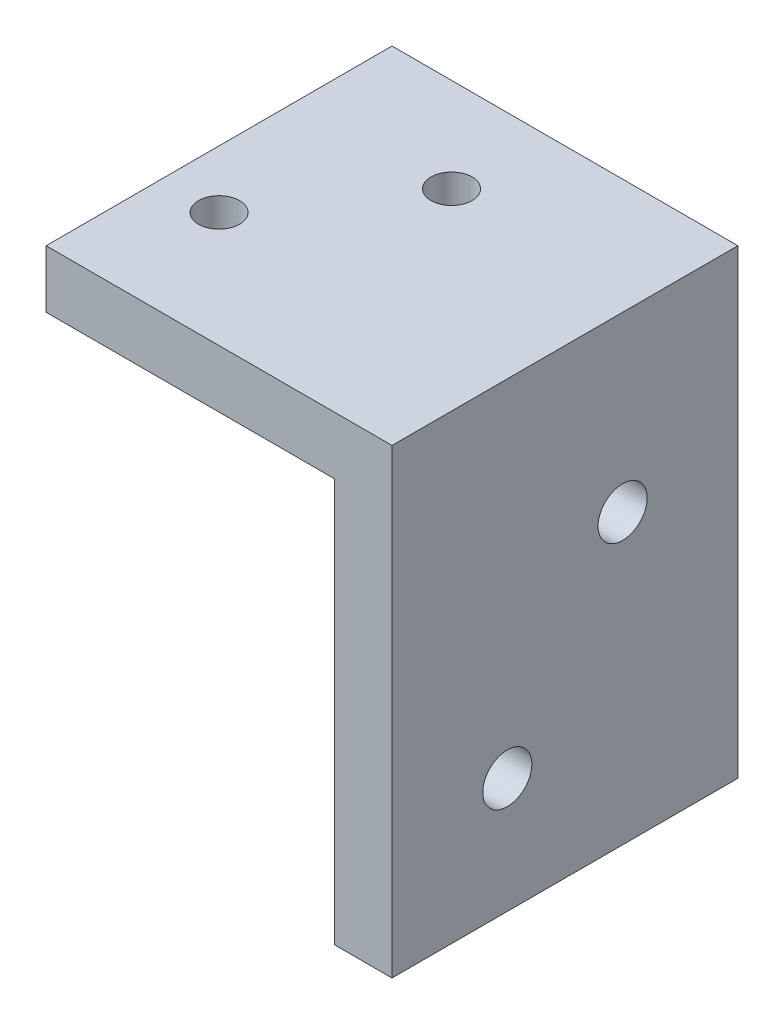
ISO-10303-21;
HEADER;
FILE_DESCRIPTION(('STEP AP214'),'2;1');
FILE_NAME('part.step','',(''),(''),'','','');
FILE_SCHEMA(('AUTOMOTIVE_DESIGN { 1 0 10303 214 1 1 1 1 }'));
ENDSEC;
DATA;
#1=APPLICATION_CONTEXT('core data for automotive mechanical design processes');
#2=APPLICATION_PROTOCOL_DEFINITION('international standard','automotive_design',2000,#1);
#3=PRODUCT_CONTEXT('',#1,'mechanical');
#4=PRODUCT('Part','Part','',(#3));
#5=PRODUCT_RELATED_PRODUCT_CATEGORY('part','',(#4));
#6=PRODUCT_DEFINITION_FORMATION('','',#4);
#7=PRODUCT_DEFINITION_CONTEXT('part definition',#1,'design');
#8=PRODUCT_DEFINITION('design','',#6,#7);
#9=PRODUCT_DEFINITION_SHAPE('','',#8);
#10=(LENGTH_UNIT() NAMED_UNIT(*) SI_UNIT(.MILLI.,.METRE.));
#11=(NAMED_UNIT(*) PLANE_ANGLE_UNIT() SI_UNIT($,.RADIAN.));
#12=(NAMED_UNIT(*) SI_UNIT($,.STERADIAN.) SOLID_ANGLE_UNIT());
#13=UNCERTAINTY_MEASURE_WITH_UNIT(LENGTH_MEASURE(1.E-05),#10,'distance_accuracy_value','');
#14=(GEOMETRIC_REPRESENTATION_CONTEXT(3) GLOBAL_UNCERTAINTY_ASSIGNED_CONTEXT((#13)) GLOBAL_UNIT_ASSIGNED_CONTEXT((#10,
#11,#12)) REPRESENTATION_CONTEXT('',''));
#15=CARTESIAN_POINT('',(0.,0.,0.));
#16=DIRECTION('',(0.,0.,1.));
#17=DIRECTION('',(1.,0.,0.));
#18=AXIS2_PLACEMENT_3D('',#15,#16,#17);
#19=CARTESIAN_POINT('',(-59.9070745842942,30.8316115702479,-12.7));
#20=DIRECTION('',(-1.,0.,0.));
#21=DIRECTION('',(0.,-1.,0.));
#22=AXIS2_PLACEMENT_3D('',#19,#20,#21);
#23=PLANE('',#22);
#24=DIRECTION('',(0.,0.,1.));
#25=VECTOR('',#24,1.);
#26=CARTESIAN_POINT('',(-59.9070745842942,27.6566115702479,-12.7));
#27=LINE('',#26,#25);
#28=CARTESIAN_POINT('',(-59.9070745842942,27.6566115702479,-12.7));
#29=VERTEX_POINT('',#28);
#30=CARTESIAN_POINT('',(-59.9070745842942,27.6566115702479,6.35));
#31=VERTEX_POINT('',#30);
#32=EDGE_CURVE('E94',#29,#31,#27,.T.);
#33=ORIENTED_EDGE('',*,*,#32,.T.);
#34=DIRECTION('',(0.,-1.,0.));
#35=VECTOR('',#34,1.);
#36=CARTESIAN_POINT('',(-59.9070745842942,30.8316115702479,6.35));
#37=LINE('',#36,#35);
#38=CARTESIAN_POINT('',(-59.9070745842942,30.8316115702479,6.35));
#39=VERTEX_POINT('',#38);
#40=EDGE_CURVE('E97',#39,#31,#37,.T.);
#41=ORIENTED_EDGE('',*,*,#40,.F.);
#42=DIRECTION('',(0.,0.,1.));
#43=VECTOR('',#42,1.);
#44=CARTESIAN_POINT('',(-59.9070745842942,30.8316115702479,-12.7));
#45=LINE('',#44,#43);
#46=CARTESIAN_POINT('',(-59.9070745842942,30.8316115702479,-12.7));
#47=VERTEX_POINT('',#46);
#48=EDGE_CURVE('E13',#47,#39,#45,.T.);
#49=ORIENTED_EDGE('',*,*,#48,.F.);
#50=DIRECTION('',(0.,-1.,0.));
#51=VECTOR('',#50,1.);
#52=CARTESIAN_POINT('',(-59.9070745842942,30.8316115702479,-12.7));
#53=LINE('',#52,#51);
#54=EDGE_CURVE('E98',#47,#29,#53,.T.);
#55=ORIENTED_EDGE('',*,*,#54,.T.);
#56=EDGE_LOOP('',(#33,#41,#49,#55));
#57=FACE_BOUND('',#56,.T.);
#58=ADVANCED_FACE('F44',(#57),#23,.T.);
#59=CARTESIAN_POINT('',(-59.9070745842942,30.8316115702479,-12.7));
#60=DIRECTION('',(0.,1.,0.));
#61=DIRECTION('',(0.,0.,1.));
#62=AXIS2_PLACEMENT_3D('',#59,#60,#61);
#63=PLANE('',#62);
#64=CARTESIAN_POINT('',(-51.4581539673336,30.8316115702479,-7.53193921682841));
#65=DIRECTION('',(0.,1.,0.));
#66=DIRECTION('',(0.,0.,1.));
#67=AXIS2_PLACEMENT_3D('',#64,#65,#66);
#68=CIRCLE('',#67,1.1303);
#69=CARTESIAN_POINT('',(-51.4581539673336,30.8316115702479,-6.40163921682841));
#70=VERTEX_POINT('',#69);
#71=EDGE_CURVE('E162',#70,#70,#68,.T.);
#72=ORIENTED_EDGE('',*,*,#71,.F.);
#73=EDGE_LOOP('',(#72));
#74=FACE_BOUND('',#73,.T.);
#75=CARTESIAN_POINT('',(-56.7320745842942,30.8316115702479,0.));
#76=DIRECTION('',(0.,1.,0.));
#77=DIRECTION('',(0.,0.,1.));
#78=AXIS2_PLACEMENT_3D('',#75,#76,#77);
#79=CIRCLE('',#78,1.1303);
#80=CARTESIAN_POINT('',(-56.7320745842942,30.8316115702479,1.1303));
#81=VERTEX_POINT('',#80);
#82=EDGE_CURVE('E151',#81,#81,#79,.T.);
#83=ORIENTED_EDGE('',*,*,#82,.F.);
#84=EDGE_LOOP('',(#83));
#85=FACE_BOUND('',#84,.T.);
#86=ORIENTED_EDGE('',*,*,#48,.T.);
#87=DIRECTION('',(-1.,0.,0.));
#88=VECTOR('',#87,1.);
#89=CARTESIAN_POINT('',(-59.9070745842942,30.8316115702479,6.35));
#90=LINE('',#89,#88);
#91=CARTESIAN_POINT('',(-40.8570745842942,30.8316115702479,6.35));
#92=VERTEX_POINT('',#91);
#93=EDGE_CURVE('E116',#92,#39,#90,.T.);
#94=ORIENTED_EDGE('',*,*,#93,.F.);
#95=DIRECTION('',(0.,0.,1.));
#96=VECTOR('',#95,1.);
#97=CARTESIAN_POINT('',(-40.8570745842942,30.8316115702479,-12.7));
#98=LINE('',#97,#96);
#99=CARTESIAN_POINT('',(-40.8570745842942,30.8316115702479,-12.7));
#100=VERTEX_POINT('',#99);
#101=EDGE_CURVE('E52',#100,#92,#98,.T.);
#102=ORIENTED_EDGE('',*,*,#101,.F.);
#103=DIRECTION('',(-1.,0.,0.));
#104=VECTOR('',#103,1.);
#105=CARTESIAN_POINT('',(-59.9070745842942,30.8316115702479,-12.7));
#106=LINE('',#105,#104);
#107=EDGE_CURVE('E103',#100,#47,#106,.T.);
#108=ORIENTED_EDGE('',*,*,#107,.T.);
#109=EDGE_LOOP('',(#86,#94,#102,#108));
#110=FACE_BOUND('',#109,.T.);
#111=ADVANCED_FACE('F188',(#74,#85,#110),#63,.T.);
#112=CARTESIAN_POINT('',(-40.8570745842942,30.8316115702479,-12.7));
#113=DIRECTION('',(1.,0.,0.));
#114=DIRECTION('',(0.,1.,0.));
#115=AXIS2_PLACEMENT_3D('',#112,#113,#114);
#116=PLANE('',#115);
#117=CARTESIAN_POINT('',(-40.8570745842942,11.7816115702479,0.));
#118=DIRECTION('',(-1.,0.,0.));
#119=DIRECTION('',(0.,0.,1.));
#120=AXIS2_PLACEMENT_3D('',#117,#118,#119);
#121=CIRCLE('',#120,1.35255);
#122=CARTESIAN_POINT('',(-40.8570745842942,11.7816115702479,1.35255));
#123=VERTEX_POINT('',#122);
#124=EDGE_CURVE('E155',#123,#123,#121,.T.);
#125=ORIENTED_EDGE('',*,*,#124,.T.);
#126=EDGE_LOOP('',(#125));
#127=FACE_BOUND('',#126,.T.);
#128=CARTESIAN_POINT('',(-40.8570745842942,21.3066115702479,-6.35));
#129=DIRECTION('',(-1.,0.,0.));
#130=DIRECTION('',(0.,0.,1.));
#131=AXIS2_PLACEMENT_3D('',#128,#129,#130);
#132=CIRCLE('',#131,1.35255);
#133=CARTESIAN_POINT('',(-40.8570745842942,21.3066115702479,-4.99745));
#134=VERTEX_POINT('',#133);
#135=EDGE_CURVE('E117',#134,#134,#132,.T.);
#136=ORIENTED_EDGE('',*,*,#135,.T.);
#137=EDGE_LOOP('',(#136));
#138=FACE_BOUND('',#137,.T.);
#139=ORIENTED_EDGE('',*,*,#101,.T.);
#140=DIRECTION('',(0.,1.,0.));
#141=VECTOR('',#140,1.);
#142=CARTESIAN_POINT('',(-40.8570745842942,30.8316115702479,6.35));
#143=LINE('',#142,#141);
#144=CARTESIAN_POINT('',(-40.8570745842942,5.43161157024793,6.35));
#145=VERTEX_POINT('',#144);
#146=EDGE_CURVE('E128',#145,#92,#143,.T.);
#147=ORIENTED_EDGE('',*,*,#146,.F.);
#148=DIRECTION('',(0.,0.,1.));
#149=VECTOR('',#148,1.);
#150=CARTESIAN_POINT('',(-40.8570745842942,5.43161157024793,-12.7));
#151=LINE('',#150,#149);
#152=CARTESIAN_POINT('',(-40.8570745842942,5.43161157024793,-12.7));
#153=VERTEX_POINT('',#152);
#154=EDGE_CURVE('E144',#153,#145,#151,.T.);
#155=ORIENTED_EDGE('',*,*,#154,.F.);
#156=DIRECTION('',(0.,1.,0.));
#157=VECTOR('',#156,1.);
#158=CARTESIAN_POINT('',(-40.8570745842942,30.8316115702479,-12.7));
#159=LINE('',#158,#157);
#160=EDGE_CURVE('E140',#153,#100,#159,.T.);
#161=ORIENTED_EDGE('',*,*,#160,.T.);
#162=EDGE_LOOP('',(#139,#147,#155,#161));
#163=FACE_BOUND('',#162,.T.);
#164=ADVANCED_FACE('F184',(#127,#138,#163),#116,.T.);
#165=CARTESIAN_POINT('',(-44.0320745842942,5.43161157024793,-12.7));
#166=DIRECTION('',(0.,-1.,0.));
#167=DIRECTION('',(1.,0.,0.));
#168=AXIS2_PLACEMENT_3D('',#165,#166,#167);
#169=PLANE('',#168);
#170=ORIENTED_EDGE('',*,*,#154,.T.);
#171=DIRECTION('',(1.,0.,0.));
#172=VECTOR('',#171,1.);
#173=CARTESIAN_POINT('',(-44.0320745842942,5.43161157024793,6.35));
#174=LINE('',#173,#172);
#175=CARTESIAN_POINT('',(-44.0320745842942,5.43161157024793,6.35));
#176=VERTEX_POINT('',#175);
#177=EDGE_CURVE('E125',#176,#145,#174,.T.);
#178=ORIENTED_EDGE('',*,*,#177,.F.);
#179=DIRECTION('',(0.,0.,1.));
#180=VECTOR('',#179,1.);
#181=CARTESIAN_POINT('',(-44.0320745842942,5.43161157024793,-12.7));
#182=LINE('',#181,#180);
#183=CARTESIAN_POINT('',(-44.0320745842942,5.43161157024793,-12.7));
#184=VERTEX_POINT('',#183);
#185=EDGE_CURVE('E146',#184,#176,#182,.T.);
#186=ORIENTED_EDGE('',*,*,#185,.F.);
#187=DIRECTION('',(1.,0.,0.));
#188=VECTOR('',#187,1.);
#189=CARTESIAN_POINT('',(-44.0320745842942,5.43161157024793,-12.7));
#190=LINE('',#189,#188);
#191=EDGE_CURVE('E137',#184,#153,#190,.T.);
#192=ORIENTED_EDGE('',*,*,#191,.T.);
#193=EDGE_LOOP('',(#170,#178,#186,#192));
#194=FACE_BOUND('',#193,.T.);
#195=ADVANCED_FACE('F174',(#194),#169,.T.);
#196=CARTESIAN_POINT('',(-44.0320745842942,27.6566115702479,-12.7));
#197=DIRECTION('',(-1.,0.,0.));
#198=DIRECTION('',(0.,0.,1.));
#199=AXIS2_PLACEMENT_3D('',#196,#197,#198);
#200=PLANE('',#199);
#201=CARTESIAN_POINT('',(-44.0320745842942,11.7816115702479,0.));
#202=DIRECTION('',(-1.,0.,0.));
#203=DIRECTION('',(0.,0.,1.));
#204=AXIS2_PLACEMENT_3D('',#201,#202,#203);
#205=CIRCLE('',#204,1.35254999999999);
#206=CARTESIAN_POINT('',(-44.0320745842942,11.7816115702479,1.35254999999999));
#207=VERTEX_POINT('',#206);
#208=EDGE_CURVE('E150',#207,#207,#205,.T.);
#209=ORIENTED_EDGE('',*,*,#208,.F.);
#210=EDGE_LOOP('',(#209));
#211=FACE_BOUND('',#210,.T.);
#212=CARTESIAN_POINT('',(-44.0320745842942,21.3066115702479,-6.35));
#213=DIRECTION('',(-1.,0.,0.));
#214=DIRECTION('',(0.,0.,1.));
#215=AXIS2_PLACEMENT_3D('',#212,#213,#214);
#216=CIRCLE('',#215,1.35254999999999);
#217=CARTESIAN_POINT('',(-44.0320745842942,21.3066115702479,-4.99745000000001));
#218=VERTEX_POINT('',#217);
#219=EDGE_CURVE('E120',#218,#218,#216,.T.);
#220=ORIENTED_EDGE('',*,*,#219,.F.);
#221=EDGE_LOOP('',(#220));
#222=FACE_BOUND('',#221,.T.);
#223=ORIENTED_EDGE('',*,*,#185,.T.);
#224=DIRECTION('',(0.,-1.,0.));
#225=VECTOR('',#224,1.);
#226=CARTESIAN_POINT('',(-44.0320745842942,27.6566115702479,6.35));
#227=LINE('',#226,#225);
#228=CARTESIAN_POINT('',(-44.0320745842942,27.6566115702479,6.35));
#229=VERTEX_POINT('',#228);
#230=EDGE_CURVE('E111',#229,#176,#227,.T.);
#231=ORIENTED_EDGE('',*,*,#230,.F.);
#232=DIRECTION('',(0.,0.,1.));
#233=VECTOR('',#232,1.);
#234=CARTESIAN_POINT('',(-44.0320745842942,27.6566115702479,-12.7));
#235=LINE('',#234,#233);
#236=CARTESIAN_POINT('',(-44.0320745842942,27.6566115702479,-12.7));
#237=VERTEX_POINT('',#236);
#238=EDGE_CURVE('E102',#237,#229,#235,.T.);
#239=ORIENTED_EDGE('',*,*,#238,.F.);
#240=DIRECTION('',(0.,-1.,0.));
#241=VECTOR('',#240,1.);
#242=CARTESIAN_POINT('',(-44.0320745842942,27.6566115702479,-12.7));
#243=LINE('',#242,#241);
#244=EDGE_CURVE('E134',#237,#184,#243,.T.);
#245=ORIENTED_EDGE('',*,*,#244,.T.);
#246=EDGE_LOOP('',(#223,#231,#239,#245));
#247=FACE_BOUND('',#246,.T.);
#248=ADVANCED_FACE('F171',(#211,#222,#247),#200,.T.);
#249=CARTESIAN_POINT('',(-59.9070745842942,27.6566115702479,-12.7));
#250=DIRECTION('',(0.,-1.,0.));
#251=DIRECTION('',(0.,0.,-1.));
#252=AXIS2_PLACEMENT_3D('',#249,#250,#251);
#253=PLANE('',#252);
#254=CARTESIAN_POINT('',(-51.4581539673336,27.6566115702479,-7.53193921682841));
#255=DIRECTION('',(0.,-1.,0.));
#256=DIRECTION('',(0.,0.,-1.));
#257=AXIS2_PLACEMENT_3D('',#254,#255,#256);
#258=CIRCLE('',#257,1.1303);
#259=CARTESIAN_POINT('',(-51.4581539673336,27.6566115702479,-8.66223921682841));
#260=VERTEX_POINT('',#259);
#261=EDGE_CURVE('E47',#260,#260,#258,.T.);
#262=ORIENTED_EDGE('',*,*,#261,.F.);
#263=EDGE_LOOP('',(#262));
#264=FACE_BOUND('',#263,.T.);
#265=CARTESIAN_POINT('',(-56.7320745842942,27.6566115702479,0.));
#266=DIRECTION('',(0.,-1.,0.));
#267=DIRECTION('',(0.,0.,-1.));
#268=AXIS2_PLACEMENT_3D('',#265,#266,#267);
#269=CIRCLE('',#268,1.1303);
#270=CARTESIAN_POINT('',(-56.7320745842942,27.6566115702479,-1.1303));
#271=VERTEX_POINT('',#270);
#272=EDGE_CURVE('E148',#271,#271,#269,.T.);
#273=ORIENTED_EDGE('',*,*,#272,.F.);
#274=EDGE_LOOP('',(#273));
#275=FACE_BOUND('',#274,.T.);
#276=ORIENTED_EDGE('',*,*,#238,.T.);
#277=DIRECTION('',(1.,0.,0.));
#278=VECTOR('',#277,1.);
#279=CARTESIAN_POINT('',(-59.9070745842942,27.6566115702479,6.35));
#280=LINE('',#279,#278);
#281=EDGE_CURVE('E106',#31,#229,#280,.T.);
#282=ORIENTED_EDGE('',*,*,#281,.F.);
#283=ORIENTED_EDGE('',*,*,#32,.F.);
#284=DIRECTION('',(1.,0.,0.));
#285=VECTOR('',#284,1.);
#286=CARTESIAN_POINT('',(-59.9070745842942,27.6566115702479,-12.7));
#287=LINE('',#286,#285);
#288=EDGE_CURVE('E132',#29,#237,#287,.T.);
#289=ORIENTED_EDGE('',*,*,#288,.T.);
#290=EDGE_LOOP('',(#276,#282,#283,#289));
#291=FACE_BOUND('',#290,.T.);
#292=ADVANCED_FACE('F107',(#264,#275,#291),#253,.T.);
#293=CARTESIAN_POINT('',(0.,0.,-12.7));
#294=DIRECTION('',(0.,0.,1.));
#295=DIRECTION('',(1.,0.,0.));
#296=AXIS2_PLACEMENT_3D('',#293,#294,#295);
#297=PLANE('',#296);
#298=ORIENTED_EDGE('',*,*,#54,.F.);
#299=ORIENTED_EDGE('',*,*,#107,.F.);
#300=ORIENTED_EDGE('',*,*,#160,.F.);
#301=ORIENTED_EDGE('',*,*,#191,.F.);
#302=ORIENTED_EDGE('',*,*,#244,.F.);
#303=ORIENTED_EDGE('',*,*,#288,.F.);
#304=EDGE_LOOP('',(#298,#299,#300,#301,#302,#303));
#305=FACE_BOUND('',#304,.T.);
#306=ADVANCED_FACE('F187',(#305),#297,.F.);
#307=CARTESIAN_POINT('',(0.,0.,6.35));
#308=DIRECTION('',(0.,0.,1.));
#309=DIRECTION('',(1.,0.,0.));
#310=AXIS2_PLACEMENT_3D('',#307,#308,#309);
#311=PLANE('',#310);
#312=ORIENTED_EDGE('',*,*,#40,.T.);
#313=ORIENTED_EDGE('',*,*,#281,.T.);
#314=ORIENTED_EDGE('',*,*,#230,.T.);
#315=ORIENTED_EDGE('',*,*,#177,.T.);
#316=ORIENTED_EDGE('',*,*,#146,.T.);
#317=ORIENTED_EDGE('',*,*,#93,.T.);
#318=EDGE_LOOP('',(#312,#313,#314,#315,#316,#317));
#319=FACE_BOUND('',#318,.T.);
#320=ADVANCED_FACE('F114',(#319),#311,.T.);
#321=CARTESIAN_POINT('',(-44.0320745842942,21.3066115702479,-6.35));
#322=DIRECTION('',(-1.,0.,0.));
#323=DIRECTION('',(0.,0.,1.));
#324=AXIS2_PLACEMENT_3D('',#321,#322,#323);
#325=CYLINDRICAL_SURFACE('',#324,1.35254999999999);
#326=ORIENTED_EDGE('',*,*,#135,.F.);
#327=EDGE_LOOP('',(#326));
#328=FACE_BOUND('',#327,.T.);
#329=ORIENTED_EDGE('',*,*,#219,.T.);
#330=EDGE_LOOP('',(#329));
#331=FACE_BOUND('',#330,.T.);
#332=ADVANCED_FACE('F169',(#328,#331),#325,.F.);
#333=CARTESIAN_POINT('',(-44.0320745842942,11.7816115702479,0.));
#334=DIRECTION('',(-1.,0.,0.));
#335=DIRECTION('',(0.,0.,1.));
#336=AXIS2_PLACEMENT_3D('',#333,#334,#335);
#337=CYLINDRICAL_SURFACE('',#336,1.35254999999999);
#338=ORIENTED_EDGE('',*,*,#124,.F.);
#339=EDGE_LOOP('',(#338));
#340=FACE_BOUND('',#339,.T.);
#341=ORIENTED_EDGE('',*,*,#208,.T.);
#342=EDGE_LOOP('',(#341));
#343=FACE_BOUND('',#342,.T.);
#344=ADVANCED_FACE('F221',(#340,#343),#337,.F.);
#345=CARTESIAN_POINT('',(-56.7320745842942,30.8316115702479,0.));
#346=DIRECTION('',(0.,1.,0.));
#347=DIRECTION('',(0.,0.,1.));
#348=AXIS2_PLACEMENT_3D('',#345,#346,#347);
#349=CYLINDRICAL_SURFACE('',#348,1.1303);
#350=ORIENTED_EDGE('',*,*,#272,.T.);
#351=EDGE_LOOP('',(#350));
#352=FACE_BOUND('',#351,.T.);
#353=ORIENTED_EDGE('',*,*,#82,.T.);
#354=EDGE_LOOP('',(#353));
#355=FACE_BOUND('',#354,.T.);
#356=ADVANCED_FACE('F215',(#352,#355),#349,.F.);
#357=CARTESIAN_POINT('',(-51.4581539673336,30.8316115702479,-7.53193921682841));
#358=DIRECTION('',(0.,1.,0.));
#359=DIRECTION('',(0.,0.,1.));
#360=AXIS2_PLACEMENT_3D('',#357,#358,#359);
#361=CYLINDRICAL_SURFACE('',#360,1.1303);
#362=ORIENTED_EDGE('',*,*,#261,.T.);
#363=EDGE_LOOP('',(#362));
#364=FACE_BOUND('',#363,.T.);
#365=ORIENTED_EDGE('',*,*,#71,.T.);
#366=EDGE_LOOP('',(#365));
#367=FACE_BOUND('',#366,.T.);
#368=ADVANCED_FACE('F212',(#364,#367),#361,.F.);
#369=CLOSED_SHELL('',(#58,#111,#164,#195,#248,#292,#306,#320,#332,#344,#356,#368));
#370=MANIFOLD_SOLID_BREP('B2',#369);
#371=ADVANCED_BREP_SHAPE_REPRESENTATION('',(#18,#370),#14);
#372=SHAPE_DEFINITION_REPRESENTATION(#9,#371);
ENDSEC;
END-ISO-10303-21;
